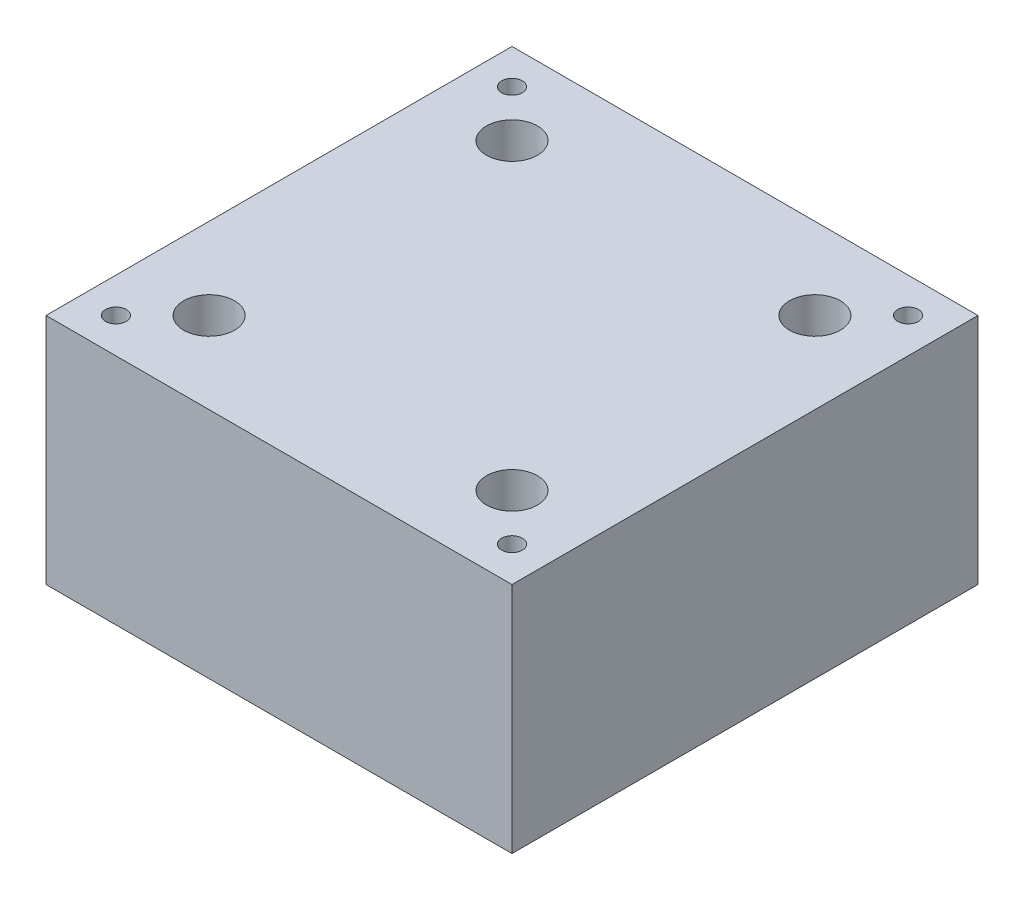
ISO-10303-21;
HEADER;
FILE_DESCRIPTION(('STEP AP214'),'2;1');
FILE_NAME('part.step','',(''),(''),'','','');
FILE_SCHEMA(('AUTOMOTIVE_DESIGN { 1 0 10303 214 1 1 1 1 }'));
ENDSEC;
DATA;
#1=APPLICATION_CONTEXT('core data for automotive mechanical design processes');
#2=APPLICATION_PROTOCOL_DEFINITION('international standard','automotive_design',2000,#1);
#3=PRODUCT_CONTEXT('',#1,'mechanical');
#4=PRODUCT('Part','Part','',(#3));
#5=PRODUCT_RELATED_PRODUCT_CATEGORY('part','',(#4));
#6=PRODUCT_DEFINITION_FORMATION('','',#4);
#7=PRODUCT_DEFINITION_CONTEXT('part definition',#1,'design');
#8=PRODUCT_DEFINITION('design','',#6,#7);
#9=PRODUCT_DEFINITION_SHAPE('','',#8);
#10=(LENGTH_UNIT() NAMED_UNIT(*) SI_UNIT(.MILLI.,.METRE.));
#11=(NAMED_UNIT(*) PLANE_ANGLE_UNIT() SI_UNIT($,.RADIAN.));
#12=(NAMED_UNIT(*) SI_UNIT($,.STERADIAN.) SOLID_ANGLE_UNIT());
#13=UNCERTAINTY_MEASURE_WITH_UNIT(LENGTH_MEASURE(1.E-05),#10,'distance_accuracy_value','');
#14=(GEOMETRIC_REPRESENTATION_CONTEXT(3) GLOBAL_UNCERTAINTY_ASSIGNED_CONTEXT((#13)) GLOBAL_UNIT_ASSIGNED_CONTEXT((#10,
#11,#12)) REPRESENTATION_CONTEXT('',''));
#15=CARTESIAN_POINT('',(0.,0.,0.));
#16=DIRECTION('',(0.,0.,1.));
#17=DIRECTION('',(1.,0.,0.));
#18=AXIS2_PLACEMENT_3D('',#15,#16,#17);
#19=CARTESIAN_POINT('',(25.4,25.4,-25.4));
#20=DIRECTION('',(-1.,0.,0.));
#21=DIRECTION('',(0.,0.,1.));
#22=AXIS2_PLACEMENT_3D('',#19,#20,#21);
#23=PLANE('',#22);
#24=DIRECTION('',(0.,0.,-1.));
#25=VECTOR('',#24,1.);
#26=CARTESIAN_POINT('',(25.4,0.,-25.4));
#27=LINE('',#26,#25);
#28=CARTESIAN_POINT('',(25.4,0.,25.4));
#29=VERTEX_POINT('',#28);
#30=CARTESIAN_POINT('',(25.4,0.,-25.4));
#31=VERTEX_POINT('',#30);
#32=EDGE_CURVE('E131',#29,#31,#27,.T.);
#33=ORIENTED_EDGE('',*,*,#32,.T.);
#34=DIRECTION('',(0.,-1.,0.));
#35=VECTOR('',#34,1.);
#36=CARTESIAN_POINT('',(25.4,25.4,-25.4));
#37=LINE('',#36,#35);
#38=CARTESIAN_POINT('',(25.4,25.4,-25.4));
#39=VERTEX_POINT('',#38);
#40=EDGE_CURVE('E11',#39,#31,#37,.T.);
#41=ORIENTED_EDGE('',*,*,#40,.F.);
#42=DIRECTION('',(0.,0.,-1.));
#43=VECTOR('',#42,1.);
#44=CARTESIAN_POINT('',(25.4,25.4,-25.4));
#45=LINE('',#44,#43);
#46=CARTESIAN_POINT('',(25.4,25.4,25.4));
#47=VERTEX_POINT('',#46);
#48=EDGE_CURVE('E132',#47,#39,#45,.T.);
#49=ORIENTED_EDGE('',*,*,#48,.F.);
#50=DIRECTION('',(0.,-1.,0.));
#51=VECTOR('',#50,1.);
#52=CARTESIAN_POINT('',(25.4,25.4,25.4));
#53=LINE('',#52,#51);
#54=EDGE_CURVE('E138',#47,#29,#53,.T.);
#55=ORIENTED_EDGE('',*,*,#54,.T.);
#56=EDGE_LOOP('',(#33,#41,#49,#55));
#57=FACE_BOUND('',#56,.T.);
#58=ADVANCED_FACE('F36',(#57),#23,.F.);
#59=CARTESIAN_POINT('',(-25.4,25.4,-25.4));
#60=DIRECTION('',(0.,0.,1.));
#61=DIRECTION('',(1.,0.,0.));
#62=AXIS2_PLACEMENT_3D('',#59,#60,#61);
#63=PLANE('',#62);
#64=DIRECTION('',(-1.,0.,0.));
#65=VECTOR('',#64,1.);
#66=CARTESIAN_POINT('',(-25.4,0.,-25.4));
#67=LINE('',#66,#65);
#68=CARTESIAN_POINT('',(-25.4,0.,-25.4));
#69=VERTEX_POINT('',#68);
#70=EDGE_CURVE('E141',#31,#69,#67,.T.);
#71=ORIENTED_EDGE('',*,*,#70,.T.);
#72=DIRECTION('',(0.,-1.,0.));
#73=VECTOR('',#72,1.);
#74=CARTESIAN_POINT('',(-25.4,25.4,-25.4));
#75=LINE('',#74,#73);
#76=CARTESIAN_POINT('',(-25.4,25.4,-25.4));
#77=VERTEX_POINT('',#76);
#78=EDGE_CURVE('E44',#77,#69,#75,.T.);
#79=ORIENTED_EDGE('',*,*,#78,.F.);
#80=DIRECTION('',(-1.,0.,0.));
#81=VECTOR('',#80,1.);
#82=CARTESIAN_POINT('',(-25.4,25.4,-25.4));
#83=LINE('',#82,#81);
#84=EDGE_CURVE('E83',#39,#77,#83,.T.);
#85=ORIENTED_EDGE('',*,*,#84,.F.);
#86=ORIENTED_EDGE('',*,*,#40,.T.);
#87=EDGE_LOOP('',(#71,#79,#85,#86));
#88=FACE_BOUND('',#87,.T.);
#89=ADVANCED_FACE('F165',(#88),#63,.F.);
#90=CARTESIAN_POINT('',(-25.4,25.4,-25.4));
#91=DIRECTION('',(1.,0.,0.));
#92=DIRECTION('',(0.,0.,-1.));
#93=AXIS2_PLACEMENT_3D('',#90,#91,#92);
#94=PLANE('',#93);
#95=DIRECTION('',(0.,0.,1.));
#96=VECTOR('',#95,1.);
#97=CARTESIAN_POINT('',(-25.4,0.,-25.4));
#98=LINE('',#97,#96);
#99=CARTESIAN_POINT('',(-25.4,0.,25.4));
#100=VERTEX_POINT('',#99);
#101=EDGE_CURVE('E70',#69,#100,#98,.T.);
#102=ORIENTED_EDGE('',*,*,#101,.T.);
#103=DIRECTION('',(0.,-1.,0.));
#104=VECTOR('',#103,1.);
#105=CARTESIAN_POINT('',(-25.4,25.4,25.4));
#106=LINE('',#105,#104);
#107=CARTESIAN_POINT('',(-25.4,25.4,25.4));
#108=VERTEX_POINT('',#107);
#109=EDGE_CURVE('E146',#108,#100,#106,.T.);
#110=ORIENTED_EDGE('',*,*,#109,.F.);
#111=DIRECTION('',(0.,0.,1.));
#112=VECTOR('',#111,1.);
#113=CARTESIAN_POINT('',(-25.4,25.4,-25.4));
#114=LINE('',#113,#112);
#115=EDGE_CURVE('E135',#77,#108,#114,.T.);
#116=ORIENTED_EDGE('',*,*,#115,.F.);
#117=ORIENTED_EDGE('',*,*,#78,.T.);
#118=EDGE_LOOP('',(#102,#110,#116,#117));
#119=FACE_BOUND('',#118,.T.);
#120=ADVANCED_FACE('F148',(#119),#94,.F.);
#121=CARTESIAN_POINT('',(-25.4,25.4,25.4));
#122=DIRECTION('',(0.,0.,-1.));
#123=DIRECTION('',(-1.,0.,0.));
#124=AXIS2_PLACEMENT_3D('',#121,#122,#123);
#125=PLANE('',#124);
#126=DIRECTION('',(1.,0.,0.));
#127=VECTOR('',#126,1.);
#128=CARTESIAN_POINT('',(-25.4,0.,25.4));
#129=LINE('',#128,#127);
#130=EDGE_CURVE('E76',#100,#29,#129,.T.);
#131=ORIENTED_EDGE('',*,*,#130,.T.);
#132=ORIENTED_EDGE('',*,*,#54,.F.);
#133=DIRECTION('',(1.,0.,0.));
#134=VECTOR('',#133,1.);
#135=CARTESIAN_POINT('',(-25.4,25.4,25.4));
#136=LINE('',#135,#134);
#137=EDGE_CURVE('E52',#108,#47,#136,.T.);
#138=ORIENTED_EDGE('',*,*,#137,.F.);
#139=ORIENTED_EDGE('',*,*,#109,.T.);
#140=EDGE_LOOP('',(#131,#132,#138,#139));
#141=FACE_BOUND('',#140,.T.);
#142=ADVANCED_FACE('F155',(#141),#125,.F.);
#143=CARTESIAN_POINT('',(0.,25.4,0.));
#144=DIRECTION('',(0.,1.,0.));
#145=DIRECTION('',(0.,0.,1.));
#146=AXIS2_PLACEMENT_3D('',#143,#144,#145);
#147=PLANE('',#146);
#148=CARTESIAN_POINT('',(-16.51,25.4,-16.51));
#149=DIRECTION('',(0.,1.,0.));
#150=DIRECTION('',(0.,0.,1.));
#151=AXIS2_PLACEMENT_3D('',#148,#149,#150);
#152=CIRCLE('',#151,2.77876);
#153=CARTESIAN_POINT('',(-16.51,25.4,-13.73124));
#154=VERTEX_POINT('',#153);
#155=EDGE_CURVE('E399',#154,#154,#152,.T.);
#156=ORIENTED_EDGE('',*,*,#155,.F.);
#157=EDGE_LOOP('',(#156));
#158=FACE_BOUND('',#157,.T.);
#159=CARTESIAN_POINT('',(16.51,25.4,-16.51));
#160=DIRECTION('',(0.,1.,0.));
#161=DIRECTION('',(0.,0.,1.));
#162=AXIS2_PLACEMENT_3D('',#159,#160,#161);
#163=CIRCLE('',#162,2.77876);
#164=CARTESIAN_POINT('',(16.51,25.4,-13.73124));
#165=VERTEX_POINT('',#164);
#166=EDGE_CURVE('E409',#165,#165,#163,.T.);
#167=ORIENTED_EDGE('',*,*,#166,.F.);
#168=EDGE_LOOP('',(#167));
#169=FACE_BOUND('',#168,.T.);
#170=CARTESIAN_POINT('',(16.51,25.4,16.51));
#171=DIRECTION('',(0.,1.,0.));
#172=DIRECTION('',(0.,0.,1.));
#173=AXIS2_PLACEMENT_3D('',#170,#171,#172);
#174=CIRCLE('',#173,2.77876);
#175=CARTESIAN_POINT('',(16.51,25.4,19.28876));
#176=VERTEX_POINT('',#175);
#177=EDGE_CURVE('E421',#176,#176,#174,.T.);
#178=ORIENTED_EDGE('',*,*,#177,.F.);
#179=EDGE_LOOP('',(#178));
#180=FACE_BOUND('',#179,.T.);
#181=CARTESIAN_POINT('',(-16.51,25.4,16.51));
#182=DIRECTION('',(0.,1.,0.));
#183=DIRECTION('',(0.,0.,1.));
#184=AXIS2_PLACEMENT_3D('',#181,#182,#183);
#185=CIRCLE('',#184,2.77876);
#186=CARTESIAN_POINT('',(-16.51,25.4,19.28876));
#187=VERTEX_POINT('',#186);
#188=EDGE_CURVE('E433',#187,#187,#185,.T.);
#189=ORIENTED_EDGE('',*,*,#188,.F.);
#190=EDGE_LOOP('',(#189));
#191=FACE_BOUND('',#190,.T.);
#192=CARTESIAN_POINT('',(-21.59,25.4,-21.59));
#193=DIRECTION('',(0.,1.,0.));
#194=DIRECTION('',(0.,0.,1.));
#195=AXIS2_PLACEMENT_3D('',#192,#193,#194);
#196=CIRCLE('',#195,1.1303);
#197=CARTESIAN_POINT('',(-21.59,25.4,-20.4597));
#198=VERTEX_POINT('',#197);
#199=EDGE_CURVE('E107',#198,#198,#196,.T.);
#200=ORIENTED_EDGE('',*,*,#199,.F.);
#201=EDGE_LOOP('',(#200));
#202=FACE_BOUND('',#201,.T.);
#203=CARTESIAN_POINT('',(21.59,25.4,-21.59));
#204=DIRECTION('',(0.,1.,0.));
#205=DIRECTION('',(0.,0.,1.));
#206=AXIS2_PLACEMENT_3D('',#203,#204,#205);
#207=CIRCLE('',#206,1.1303);
#208=CARTESIAN_POINT('',(21.59,25.4,-20.4597));
#209=VERTEX_POINT('',#208);
#210=EDGE_CURVE('E106',#209,#209,#207,.T.);
#211=ORIENTED_EDGE('',*,*,#210,.F.);
#212=EDGE_LOOP('',(#211));
#213=FACE_BOUND('',#212,.T.);
#214=CARTESIAN_POINT('',(21.59,25.4,21.59));
#215=DIRECTION('',(0.,1.,0.));
#216=DIRECTION('',(0.,0.,1.));
#217=AXIS2_PLACEMENT_3D('',#214,#215,#216);
#218=CIRCLE('',#217,1.1303);
#219=CARTESIAN_POINT('',(21.59,25.4,22.7203));
#220=VERTEX_POINT('',#219);
#221=EDGE_CURVE('E119',#220,#220,#218,.T.);
#222=ORIENTED_EDGE('',*,*,#221,.F.);
#223=EDGE_LOOP('',(#222));
#224=FACE_BOUND('',#223,.T.);
#225=CARTESIAN_POINT('',(-21.59,25.4,21.59));
#226=DIRECTION('',(0.,1.,0.));
#227=DIRECTION('',(0.,0.,1.));
#228=AXIS2_PLACEMENT_3D('',#225,#226,#227);
#229=CIRCLE('',#228,1.1303);
#230=CARTESIAN_POINT('',(-21.59,25.4,22.7203));
#231=VERTEX_POINT('',#230);
#232=EDGE_CURVE('E125',#231,#231,#229,.T.);
#233=ORIENTED_EDGE('',*,*,#232,.F.);
#234=EDGE_LOOP('',(#233));
#235=FACE_BOUND('',#234,.T.);
#236=ORIENTED_EDGE('',*,*,#48,.T.);
#237=ORIENTED_EDGE('',*,*,#84,.T.);
#238=ORIENTED_EDGE('',*,*,#115,.T.);
#239=ORIENTED_EDGE('',*,*,#137,.T.);
#240=EDGE_LOOP('',(#236,#237,#238,#239));
#241=FACE_BOUND('',#240,.T.);
#242=ADVANCED_FACE('F157',(#158,#169,#180,#191,#202,#213,#224,#235,#241),#147,.T.);
#243=CARTESIAN_POINT('',(0.,0.,0.));
#244=DIRECTION('',(0.,1.,0.));
#245=DIRECTION('',(0.,0.,1.));
#246=AXIS2_PLACEMENT_3D('',#243,#244,#245);
#247=PLANE('',#246);
#248=CARTESIAN_POINT('',(-16.51,0.,-16.51));
#249=DIRECTION('',(0.,1.,0.));
#250=DIRECTION('',(0.,0.,1.));
#251=AXIS2_PLACEMENT_3D('',#248,#249,#250);
#252=CIRCLE('',#251,1.63194999999999);
#253=CARTESIAN_POINT('',(-16.51,0.,-14.87805));
#254=VERTEX_POINT('',#253);
#255=EDGE_CURVE('E406',#254,#254,#252,.T.);
#256=ORIENTED_EDGE('',*,*,#255,.T.);
#257=EDGE_LOOP('',(#256));
#258=FACE_BOUND('',#257,.T.);
#259=CARTESIAN_POINT('',(16.51,0.,-16.51));
#260=DIRECTION('',(0.,1.,0.));
#261=DIRECTION('',(0.,0.,1.));
#262=AXIS2_PLACEMENT_3D('',#259,#260,#261);
#263=CIRCLE('',#262,1.63194999999999);
#264=CARTESIAN_POINT('',(16.51,0.,-14.87805));
#265=VERTEX_POINT('',#264);
#266=EDGE_CURVE('E418',#265,#265,#263,.T.);
#267=ORIENTED_EDGE('',*,*,#266,.T.);
#268=EDGE_LOOP('',(#267));
#269=FACE_BOUND('',#268,.T.);
#270=CARTESIAN_POINT('',(16.51,0.,16.51));
#271=DIRECTION('',(0.,1.,0.));
#272=DIRECTION('',(0.,0.,1.));
#273=AXIS2_PLACEMENT_3D('',#270,#271,#272);
#274=CIRCLE('',#273,1.63194999999999);
#275=CARTESIAN_POINT('',(16.51,0.,18.14195));
#276=VERTEX_POINT('',#275);
#277=EDGE_CURVE('E430',#276,#276,#274,.T.);
#278=ORIENTED_EDGE('',*,*,#277,.T.);
#279=EDGE_LOOP('',(#278));
#280=FACE_BOUND('',#279,.T.);
#281=CARTESIAN_POINT('',(-16.51,0.,16.51));
#282=DIRECTION('',(0.,1.,0.));
#283=DIRECTION('',(0.,0.,1.));
#284=AXIS2_PLACEMENT_3D('',#281,#282,#283);
#285=CIRCLE('',#284,1.63194999999999);
#286=CARTESIAN_POINT('',(-16.51,0.,18.14195));
#287=VERTEX_POINT('',#286);
#288=EDGE_CURVE('E113',#287,#287,#285,.T.);
#289=ORIENTED_EDGE('',*,*,#288,.T.);
#290=EDGE_LOOP('',(#289));
#291=FACE_BOUND('',#290,.T.);
#292=ORIENTED_EDGE('',*,*,#32,.F.);
#293=ORIENTED_EDGE('',*,*,#130,.F.);
#294=ORIENTED_EDGE('',*,*,#101,.F.);
#295=ORIENTED_EDGE('',*,*,#70,.F.);
#296=EDGE_LOOP('',(#292,#293,#294,#295));
#297=FACE_BOUND('',#296,.T.);
#298=ADVANCED_FACE('F151',(#258,#269,#280,#291,#297),#247,.F.);
#299=CARTESIAN_POINT('',(-21.59,5.1054,21.59));
#300=DIRECTION('',(0.,1.,0.));
#301=DIRECTION('',(0.,0.,1.));
#302=AXIS2_PLACEMENT_3D('',#299,#300,#301);
#303=CONICAL_SURFACE('',#302,1.1303,1.02974425867665);
#304=CARTESIAN_POINT('',(-21.59,4.42624724231314,21.59));
#305=VERTEX_POINT('',#304);
#306=VERTEX_LOOP('',#305);
#307=FACE_BOUND('',#306,.T.);
#308=CARTESIAN_POINT('',(-21.59,5.1054,21.59));
#309=DIRECTION('',(0.,1.,0.));
#310=DIRECTION('',(0.,0.,1.));
#311=AXIS2_PLACEMENT_3D('',#308,#309,#310);
#312=CIRCLE('',#311,1.1303);
#313=CARTESIAN_POINT('',(-21.59,5.1054,22.7203));
#314=VERTEX_POINT('',#313);
#315=EDGE_CURVE('E128',#314,#314,#312,.T.);
#316=ORIENTED_EDGE('',*,*,#315,.T.);
#317=EDGE_LOOP('',(#316));
#318=FACE_BOUND('',#317,.T.);
#319=ADVANCED_FACE('F188',(#307,#318),#303,.F.);
#320=CARTESIAN_POINT('',(-21.59,25.4,21.59));
#321=DIRECTION('',(0.,1.,0.));
#322=DIRECTION('',(0.,0.,1.));
#323=AXIS2_PLACEMENT_3D('',#320,#321,#322);
#324=CYLINDRICAL_SURFACE('',#323,1.1303);
#325=ORIENTED_EDGE('',*,*,#315,.F.);
#326=EDGE_LOOP('',(#325));
#327=FACE_BOUND('',#326,.T.);
#328=ORIENTED_EDGE('',*,*,#232,.T.);
#329=EDGE_LOOP('',(#328));
#330=FACE_BOUND('',#329,.T.);
#331=ADVANCED_FACE('F193',(#327,#330),#324,.F.);
#332=CARTESIAN_POINT('',(21.59,5.1054,21.59));
#333=DIRECTION('',(0.,1.,0.));
#334=DIRECTION('',(0.,0.,1.));
#335=AXIS2_PLACEMENT_3D('',#332,#333,#334);
#336=CONICAL_SURFACE('',#335,1.1303,1.02974425867665);
#337=CARTESIAN_POINT('',(21.59,4.42624724231314,21.59));
#338=VERTEX_POINT('',#337);
#339=VERTEX_LOOP('',#338);
#340=FACE_BOUND('',#339,.T.);
#341=CARTESIAN_POINT('',(21.59,5.1054,21.59));
#342=DIRECTION('',(0.,1.,0.));
#343=DIRECTION('',(0.,0.,1.));
#344=AXIS2_PLACEMENT_3D('',#341,#342,#343);
#345=CIRCLE('',#344,1.1303);
#346=CARTESIAN_POINT('',(21.59,5.1054,22.7203));
#347=VERTEX_POINT('',#346);
#348=EDGE_CURVE('E122',#347,#347,#345,.T.);
#349=ORIENTED_EDGE('',*,*,#348,.T.);
#350=EDGE_LOOP('',(#349));
#351=FACE_BOUND('',#350,.T.);
#352=ADVANCED_FACE('F205',(#340,#351),#336,.F.);
#353=CARTESIAN_POINT('',(21.59,25.4,21.59));
#354=DIRECTION('',(0.,1.,0.));
#355=DIRECTION('',(0.,0.,1.));
#356=AXIS2_PLACEMENT_3D('',#353,#354,#355);
#357=CYLINDRICAL_SURFACE('',#356,1.1303);
#358=ORIENTED_EDGE('',*,*,#348,.F.);
#359=EDGE_LOOP('',(#358));
#360=FACE_BOUND('',#359,.T.);
#361=ORIENTED_EDGE('',*,*,#221,.T.);
#362=EDGE_LOOP('',(#361));
#363=FACE_BOUND('',#362,.T.);
#364=ADVANCED_FACE('F215',(#360,#363),#357,.F.);
#365=CARTESIAN_POINT('',(21.59,5.1054,-21.59));
#366=DIRECTION('',(0.,1.,0.));
#367=DIRECTION('',(0.,0.,1.));
#368=AXIS2_PLACEMENT_3D('',#365,#366,#367);
#369=CONICAL_SURFACE('',#368,1.1303,1.02974425867665);
#370=CARTESIAN_POINT('',(21.59,4.42624724231314,-21.59));
#371=VERTEX_POINT('',#370);
#372=VERTEX_LOOP('',#371);
#373=FACE_BOUND('',#372,.T.);
#374=CARTESIAN_POINT('',(21.59,5.1054,-21.59));
#375=DIRECTION('',(0.,1.,0.));
#376=DIRECTION('',(0.,0.,1.));
#377=AXIS2_PLACEMENT_3D('',#374,#375,#376);
#378=CIRCLE('',#377,1.1303);
#379=CARTESIAN_POINT('',(21.59,5.1054,-20.4597));
#380=VERTEX_POINT('',#379);
#381=EDGE_CURVE('E110',#380,#380,#378,.T.);
#382=ORIENTED_EDGE('',*,*,#381,.T.);
#383=EDGE_LOOP('',(#382));
#384=FACE_BOUND('',#383,.T.);
#385=ADVANCED_FACE('F225',(#373,#384),#369,.F.);
#386=CARTESIAN_POINT('',(21.59,25.4,-21.59));
#387=DIRECTION('',(0.,1.,0.));
#388=DIRECTION('',(0.,0.,1.));
#389=AXIS2_PLACEMENT_3D('',#386,#387,#388);
#390=CYLINDRICAL_SURFACE('',#389,1.1303);
#391=ORIENTED_EDGE('',*,*,#381,.F.);
#392=EDGE_LOOP('',(#391));
#393=FACE_BOUND('',#392,.T.);
#394=ORIENTED_EDGE('',*,*,#210,.T.);
#395=EDGE_LOOP('',(#394));
#396=FACE_BOUND('',#395,.T.);
#397=ADVANCED_FACE('F100',(#393,#396),#390,.F.);
#398=CARTESIAN_POINT('',(-21.59,5.1054,-21.59));
#399=DIRECTION('',(0.,1.,0.));
#400=DIRECTION('',(0.,0.,1.));
#401=AXIS2_PLACEMENT_3D('',#398,#399,#400);
#402=CONICAL_SURFACE('',#401,1.1303,1.02974425867665);
#403=CARTESIAN_POINT('',(-21.59,4.42624724231314,-21.59));
#404=VERTEX_POINT('',#403);
#405=VERTEX_LOOP('',#404);
#406=FACE_BOUND('',#405,.T.);
#407=CARTESIAN_POINT('',(-21.59,5.1054,-21.59));
#408=DIRECTION('',(0.,1.,0.));
#409=DIRECTION('',(0.,0.,1.));
#410=AXIS2_PLACEMENT_3D('',#407,#408,#409);
#411=CIRCLE('',#410,1.1303);
#412=CARTESIAN_POINT('',(-21.59,5.1054,-20.4597));
#413=VERTEX_POINT('',#412);
#414=EDGE_CURVE('E104',#413,#413,#411,.T.);
#415=ORIENTED_EDGE('',*,*,#414,.T.);
#416=EDGE_LOOP('',(#415));
#417=FACE_BOUND('',#416,.T.);
#418=ADVANCED_FACE('F96',(#406,#417),#402,.F.);
#419=CARTESIAN_POINT('',(-21.59,25.4,-21.59));
#420=DIRECTION('',(0.,1.,0.));
#421=DIRECTION('',(0.,0.,1.));
#422=AXIS2_PLACEMENT_3D('',#419,#420,#421);
#423=CYLINDRICAL_SURFACE('',#422,1.1303);
#424=ORIENTED_EDGE('',*,*,#414,.F.);
#425=EDGE_LOOP('',(#424));
#426=FACE_BOUND('',#425,.T.);
#427=ORIENTED_EDGE('',*,*,#199,.T.);
#428=EDGE_LOOP('',(#427));
#429=FACE_BOUND('',#428,.T.);
#430=ADVANCED_FACE('F99',(#426,#429),#423,.F.);
#431=CARTESIAN_POINT('',(-16.51,25.4,16.51));
#432=DIRECTION('',(0.,1.,0.));
#433=DIRECTION('',(0.,0.,1.));
#434=AXIS2_PLACEMENT_3D('',#431,#432,#433);
#435=CYLINDRICAL_SURFACE('',#434,1.63195);
#436=ORIENTED_EDGE('',*,*,#288,.F.);
#437=EDGE_LOOP('',(#436));
#438=FACE_BOUND('',#437,.T.);
#439=CARTESIAN_POINT('',(-16.51,17.4752,16.51));
#440=DIRECTION('',(0.,1.,0.));
#441=DIRECTION('',(0.,0.,1.));
#442=AXIS2_PLACEMENT_3D('',#439,#440,#441);
#443=CIRCLE('',#442,1.63195);
#444=CARTESIAN_POINT('',(-16.51,17.4752,18.14195));
#445=VERTEX_POINT('',#444);
#446=EDGE_CURVE('E439',#445,#445,#443,.T.);
#447=ORIENTED_EDGE('',*,*,#446,.T.);
#448=EDGE_LOOP('',(#447));
#449=FACE_BOUND('',#448,.T.);
#450=ADVANCED_FACE('F259',(#438,#449),#435,.F.);
#451=CARTESIAN_POINT('',(-14.87805,17.4752,16.51));
#452=DIRECTION('',(0.,-1.,0.));
#453=DIRECTION('',(0.,0.,-1.));
#454=AXIS2_PLACEMENT_3D('',#451,#452,#453);
#455=PLANE('',#454);
#456=ORIENTED_EDGE('',*,*,#446,.F.);
#457=EDGE_LOOP('',(#456));
#458=FACE_BOUND('',#457,.T.);
#459=CARTESIAN_POINT('',(-16.51,17.4752,16.51));
#460=DIRECTION('',(0.,1.,0.));
#461=DIRECTION('',(0.,0.,1.));
#462=AXIS2_PLACEMENT_3D('',#459,#460,#461);
#463=CIRCLE('',#462,2.77876);
#464=CARTESIAN_POINT('',(-16.51,17.4752,19.28876));
#465=VERTEX_POINT('',#464);
#466=EDGE_CURVE('E436',#465,#465,#463,.T.);
#467=ORIENTED_EDGE('',*,*,#466,.T.);
#468=EDGE_LOOP('',(#467));
#469=FACE_BOUND('',#468,.T.);
#470=ADVANCED_FACE('F279',(#458,#469),#455,.F.);
#471=CARTESIAN_POINT('',(-16.51,25.4,16.51));
#472=DIRECTION('',(0.,1.,0.));
#473=DIRECTION('',(0.,0.,1.));
#474=AXIS2_PLACEMENT_3D('',#471,#472,#473);
#475=CYLINDRICAL_SURFACE('',#474,2.77876);
#476=ORIENTED_EDGE('',*,*,#466,.F.);
#477=EDGE_LOOP('',(#476));
#478=FACE_BOUND('',#477,.T.);
#479=ORIENTED_EDGE('',*,*,#188,.T.);
#480=EDGE_LOOP('',(#479));
#481=FACE_BOUND('',#480,.T.);
#482=ADVANCED_FACE('F289',(#478,#481),#475,.F.);
#483=CARTESIAN_POINT('',(16.51,25.4,16.51));
#484=DIRECTION('',(0.,1.,0.));
#485=DIRECTION('',(0.,0.,1.));
#486=AXIS2_PLACEMENT_3D('',#483,#484,#485);
#487=CYLINDRICAL_SURFACE('',#486,1.63195);
#488=ORIENTED_EDGE('',*,*,#277,.F.);
#489=EDGE_LOOP('',(#488));
#490=FACE_BOUND('',#489,.T.);
#491=CARTESIAN_POINT('',(16.51,17.4752,16.51));
#492=DIRECTION('',(0.,1.,0.));
#493=DIRECTION('',(0.,0.,1.));
#494=AXIS2_PLACEMENT_3D('',#491,#492,#493);
#495=CIRCLE('',#494,1.63195);
#496=CARTESIAN_POINT('',(16.51,17.4752,18.14195));
#497=VERTEX_POINT('',#496);
#498=EDGE_CURVE('E427',#497,#497,#495,.T.);
#499=ORIENTED_EDGE('',*,*,#498,.T.);
#500=EDGE_LOOP('',(#499));
#501=FACE_BOUND('',#500,.T.);
#502=ADVANCED_FACE('F299',(#490,#501),#487,.F.);
#503=CARTESIAN_POINT('',(18.14195,17.4752,16.51));
#504=DIRECTION('',(0.,-1.,0.));
#505=DIRECTION('',(0.,0.,-1.));
#506=AXIS2_PLACEMENT_3D('',#503,#504,#505);
#507=PLANE('',#506);
#508=ORIENTED_EDGE('',*,*,#498,.F.);
#509=EDGE_LOOP('',(#508));
#510=FACE_BOUND('',#509,.T.);
#511=CARTESIAN_POINT('',(16.51,17.4752,16.51));
#512=DIRECTION('',(0.,1.,0.));
#513=DIRECTION('',(0.,0.,1.));
#514=AXIS2_PLACEMENT_3D('',#511,#512,#513);
#515=CIRCLE('',#514,2.77876);
#516=CARTESIAN_POINT('',(16.51,17.4752,19.28876));
#517=VERTEX_POINT('',#516);
#518=EDGE_CURVE('E424',#517,#517,#515,.T.);
#519=ORIENTED_EDGE('',*,*,#518,.T.);
#520=EDGE_LOOP('',(#519));
#521=FACE_BOUND('',#520,.T.);
#522=ADVANCED_FACE('F309',(#510,#521),#507,.F.);
#523=CARTESIAN_POINT('',(16.51,25.4,16.51));
#524=DIRECTION('',(0.,1.,0.));
#525=DIRECTION('',(0.,0.,1.));
#526=AXIS2_PLACEMENT_3D('',#523,#524,#525);
#527=CYLINDRICAL_SURFACE('',#526,2.77876);
#528=ORIENTED_EDGE('',*,*,#518,.F.);
#529=EDGE_LOOP('',(#528));
#530=FACE_BOUND('',#529,.T.);
#531=ORIENTED_EDGE('',*,*,#177,.T.);
#532=EDGE_LOOP('',(#531));
#533=FACE_BOUND('',#532,.T.);
#534=ADVANCED_FACE('F319',(#530,#533),#527,.F.);
#535=CARTESIAN_POINT('',(16.51,25.4,-16.51));
#536=DIRECTION('',(0.,1.,0.));
#537=DIRECTION('',(0.,0.,1.));
#538=AXIS2_PLACEMENT_3D('',#535,#536,#537);
#539=CYLINDRICAL_SURFACE('',#538,1.63195);
#540=ORIENTED_EDGE('',*,*,#266,.F.);
#541=EDGE_LOOP('',(#540));
#542=FACE_BOUND('',#541,.T.);
#543=CARTESIAN_POINT('',(16.51,17.4752,-16.51));
#544=DIRECTION('',(0.,1.,0.));
#545=DIRECTION('',(0.,0.,1.));
#546=AXIS2_PLACEMENT_3D('',#543,#544,#545);
#547=CIRCLE('',#546,1.63195);
#548=CARTESIAN_POINT('',(16.51,17.4752,-14.87805));
#549=VERTEX_POINT('',#548);
#550=EDGE_CURVE('E415',#549,#549,#547,.T.);
#551=ORIENTED_EDGE('',*,*,#550,.T.);
#552=EDGE_LOOP('',(#551));
#553=FACE_BOUND('',#552,.T.);
#554=ADVANCED_FACE('F329',(#542,#553),#539,.F.);
#555=CARTESIAN_POINT('',(18.14195,17.4752,-16.51));
#556=DIRECTION('',(0.,-1.,0.));
#557=DIRECTION('',(0.,0.,-1.));
#558=AXIS2_PLACEMENT_3D('',#555,#556,#557);
#559=PLANE('',#558);
#560=ORIENTED_EDGE('',*,*,#550,.F.);
#561=EDGE_LOOP('',(#560));
#562=FACE_BOUND('',#561,.T.);
#563=CARTESIAN_POINT('',(16.51,17.4752,-16.51));
#564=DIRECTION('',(0.,1.,0.));
#565=DIRECTION('',(0.,0.,1.));
#566=AXIS2_PLACEMENT_3D('',#563,#564,#565);
#567=CIRCLE('',#566,2.77876);
#568=CARTESIAN_POINT('',(16.51,17.4752,-13.73124));
#569=VERTEX_POINT('',#568);
#570=EDGE_CURVE('E412',#569,#569,#567,.T.);
#571=ORIENTED_EDGE('',*,*,#570,.T.);
#572=EDGE_LOOP('',(#571));
#573=FACE_BOUND('',#572,.T.);
#574=ADVANCED_FACE('F339',(#562,#573),#559,.F.);
#575=CARTESIAN_POINT('',(16.51,25.4,-16.51));
#576=DIRECTION('',(0.,1.,0.));
#577=DIRECTION('',(0.,0.,1.));
#578=AXIS2_PLACEMENT_3D('',#575,#576,#577);
#579=CYLINDRICAL_SURFACE('',#578,2.77876);
#580=ORIENTED_EDGE('',*,*,#570,.F.);
#581=EDGE_LOOP('',(#580));
#582=FACE_BOUND('',#581,.T.);
#583=ORIENTED_EDGE('',*,*,#166,.T.);
#584=EDGE_LOOP('',(#583));
#585=FACE_BOUND('',#584,.T.);
#586=ADVANCED_FACE('F349',(#582,#585),#579,.F.);
#587=CARTESIAN_POINT('',(-16.51,25.4,-16.51));
#588=DIRECTION('',(0.,1.,0.));
#589=DIRECTION('',(0.,0.,1.));
#590=AXIS2_PLACEMENT_3D('',#587,#588,#589);
#591=CYLINDRICAL_SURFACE('',#590,1.63195);
#592=ORIENTED_EDGE('',*,*,#255,.F.);
#593=EDGE_LOOP('',(#592));
#594=FACE_BOUND('',#593,.T.);
#595=CARTESIAN_POINT('',(-16.51,17.4752,-16.51));
#596=DIRECTION('',(0.,1.,0.));
#597=DIRECTION('',(0.,0.,1.));
#598=AXIS2_PLACEMENT_3D('',#595,#596,#597);
#599=CIRCLE('',#598,1.63195);
#600=CARTESIAN_POINT('',(-16.51,17.4752,-14.87805));
#601=VERTEX_POINT('',#600);
#602=EDGE_CURVE('E401',#601,#601,#599,.T.);
#603=ORIENTED_EDGE('',*,*,#602,.T.);
#604=EDGE_LOOP('',(#603));
#605=FACE_BOUND('',#604,.T.);
#606=ADVANCED_FACE('F359',(#594,#605),#591,.F.);
#607=CARTESIAN_POINT('',(-14.87805,17.4752,-16.51));
#608=DIRECTION('',(0.,-1.,0.));
#609=DIRECTION('',(0.,0.,-1.));
#610=AXIS2_PLACEMENT_3D('',#607,#608,#609);
#611=PLANE('',#610);
#612=ORIENTED_EDGE('',*,*,#602,.F.);
#613=EDGE_LOOP('',(#612));
#614=FACE_BOUND('',#613,.T.);
#615=CARTESIAN_POINT('',(-16.51,17.4752,-16.51));
#616=DIRECTION('',(0.,1.,0.));
#617=DIRECTION('',(0.,0.,1.));
#618=AXIS2_PLACEMENT_3D('',#615,#616,#617);
#619=CIRCLE('',#618,2.77876);
#620=CARTESIAN_POINT('',(-16.51,17.4752,-13.73124));
#621=VERTEX_POINT('',#620);
#622=EDGE_CURVE('E396',#621,#621,#619,.T.);
#623=ORIENTED_EDGE('',*,*,#622,.T.);
#624=EDGE_LOOP('',(#623));
#625=FACE_BOUND('',#624,.T.);
#626=ADVANCED_FACE('F369',(#614,#625),#611,.F.);
#627=CARTESIAN_POINT('',(-16.51,25.4,-16.51));
#628=DIRECTION('',(0.,1.,0.));
#629=DIRECTION('',(0.,0.,1.));
#630=AXIS2_PLACEMENT_3D('',#627,#628,#629);
#631=CYLINDRICAL_SURFACE('',#630,2.77876);
#632=ORIENTED_EDGE('',*,*,#622,.F.);
#633=EDGE_LOOP('',(#632));
#634=FACE_BOUND('',#633,.T.);
#635=ORIENTED_EDGE('',*,*,#155,.T.);
#636=EDGE_LOOP('',(#635));
#637=FACE_BOUND('',#636,.T.);
#638=ADVANCED_FACE('F379',(#634,#637),#631,.F.);
#639=CLOSED_SHELL('',(#58,#89,#120,#142,#242,#298,#319,#331,#352,#364,#385,#397,#418,#430,#450,
#470,#482,#502,#522,#534,#554,#574,#586,#606,#626,#638));
#640=MANIFOLD_SOLID_BREP('B2',#639);
#641=ADVANCED_BREP_SHAPE_REPRESENTATION('',(#18,#640),#14);
#642=SHAPE_DEFINITION_REPRESENTATION(#9,#641);
ENDSEC;
END-ISO-10303-21;
